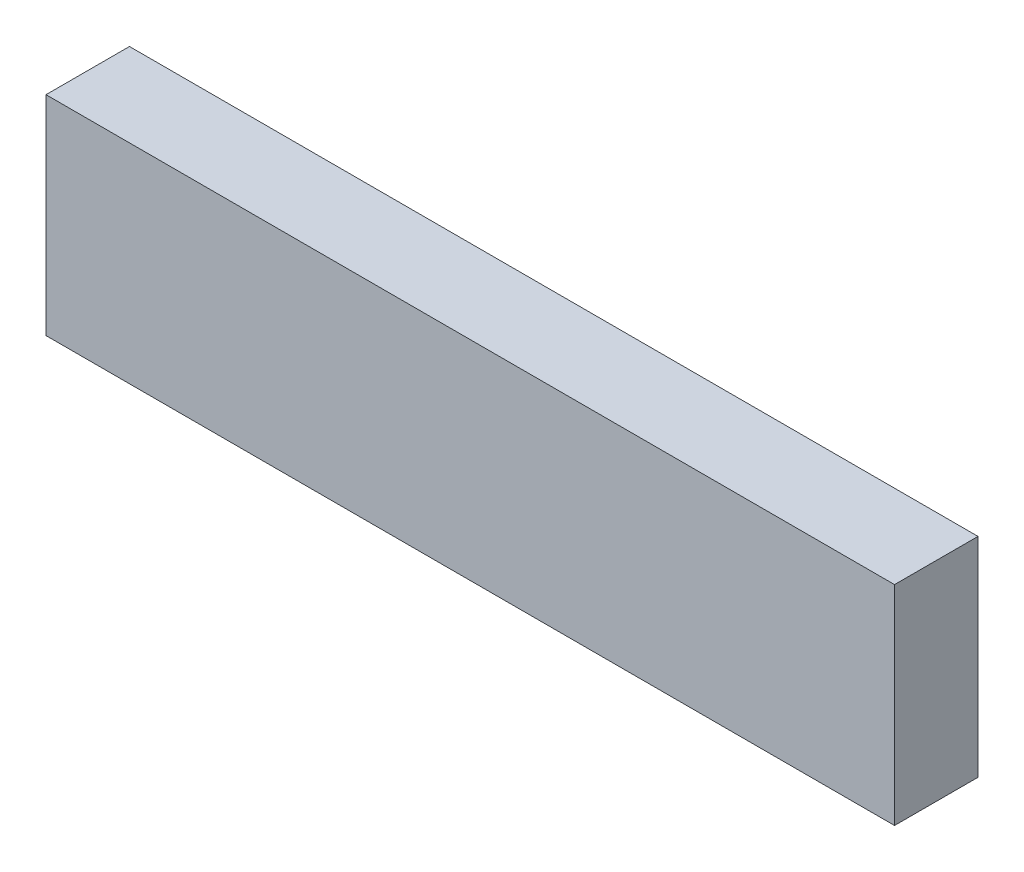
ISO-10303-21;
HEADER;
FILE_DESCRIPTION(('STEP AP214'),'2;1');
FILE_NAME('part.step','',(''),(''),'','','');
FILE_SCHEMA(('AUTOMOTIVE_DESIGN { 1 0 10303 214 1 1 1 1 }'));
ENDSEC;
DATA;
#1=APPLICATION_CONTEXT('core data for automotive mechanical design processes');
#2=APPLICATION_PROTOCOL_DEFINITION('international standard','automotive_design',2000,#1);
#3=PRODUCT_CONTEXT('',#1,'mechanical');
#4=PRODUCT('Part','Part','',(#3));
#5=PRODUCT_RELATED_PRODUCT_CATEGORY('part','',(#4));
#6=PRODUCT_DEFINITION_FORMATION('','',#4);
#7=PRODUCT_DEFINITION_CONTEXT('part definition',#1,'design');
#8=PRODUCT_DEFINITION('design','',#6,#7);
#9=PRODUCT_DEFINITION_SHAPE('','',#8);
#10=(LENGTH_UNIT() NAMED_UNIT(*) SI_UNIT(.MILLI.,.METRE.));
#11=(NAMED_UNIT(*) PLANE_ANGLE_UNIT() SI_UNIT($,.RADIAN.));
#12=(NAMED_UNIT(*) SI_UNIT($,.STERADIAN.) SOLID_ANGLE_UNIT());
#13=UNCERTAINTY_MEASURE_WITH_UNIT(LENGTH_MEASURE(1.E-05),#10,'distance_accuracy_value','');
#14=(GEOMETRIC_REPRESENTATION_CONTEXT(3) GLOBAL_UNCERTAINTY_ASSIGNED_CONTEXT((#13)) GLOBAL_UNIT_ASSIGNED_CONTEXT((#10,
#11,#12)) REPRESENTATION_CONTEXT('',''));
#15=CARTESIAN_POINT('',(0.,0.,0.));
#16=DIRECTION('',(0.,0.,1.));
#17=DIRECTION('',(1.,0.,0.));
#18=AXIS2_PLACEMENT_3D('',#15,#16,#17);
#19=CARTESIAN_POINT('',(61.,15.,-6.));
#20=DIRECTION('',(0.,0.,1.));
#21=DIRECTION('',(0.,-1.,0.));
#22=AXIS2_PLACEMENT_3D('',#19,#20,#21);
#23=PLANE('',#22);
#24=DIRECTION('',(0.,1.,0.));
#25=VECTOR('',#24,1.);
#26=CARTESIAN_POINT('',(-61.,15.,-6.));
#27=LINE('',#26,#25);
#28=CARTESIAN_POINT('',(-61.,-15.,-6.));
#29=VERTEX_POINT('',#28);
#30=CARTESIAN_POINT('',(-61.,15.,-6.));
#31=VERTEX_POINT('',#30);
#32=EDGE_CURVE('E104',#29,#31,#27,.T.);
#33=ORIENTED_EDGE('',*,*,#32,.T.);
#34=DIRECTION('',(-1.,0.,0.));
#35=VECTOR('',#34,1.);
#36=CARTESIAN_POINT('',(61.,15.,-6.));
#37=LINE('',#36,#35);
#38=CARTESIAN_POINT('',(61.,15.,-6.));
#39=VERTEX_POINT('',#38);
#40=EDGE_CURVE('E11',#39,#31,#37,.T.);
#41=ORIENTED_EDGE('',*,*,#40,.F.);
#42=DIRECTION('',(0.,1.,0.));
#43=VECTOR('',#42,1.);
#44=CARTESIAN_POINT('',(61.,15.,-6.));
#45=LINE('',#44,#43);
#46=CARTESIAN_POINT('',(61.,-15.,-6.));
#47=VERTEX_POINT('',#46);
#48=EDGE_CURVE('E92',#47,#39,#45,.T.);
#49=ORIENTED_EDGE('',*,*,#48,.F.);
#50=DIRECTION('',(-1.,0.,0.));
#51=VECTOR('',#50,1.);
#52=CARTESIAN_POINT('',(61.,-15.,-6.));
#53=LINE('',#52,#51);
#54=EDGE_CURVE('E100',#47,#29,#53,.T.);
#55=ORIENTED_EDGE('',*,*,#54,.T.);
#56=EDGE_LOOP('',(#33,#41,#49,#55));
#57=FACE_BOUND('',#56,.T.);
#58=ADVANCED_FACE('F41',(#57),#23,.F.);
#59=CARTESIAN_POINT('',(61.,15.,6.));
#60=DIRECTION('',(0.,-1.,0.));
#61=DIRECTION('',(0.,0.,-1.));
#62=AXIS2_PLACEMENT_3D('',#59,#60,#61);
#63=PLANE('',#62);
#64=DIRECTION('',(0.,0.,1.));
#65=VECTOR('',#64,1.);
#66=CARTESIAN_POINT('',(-61.,15.,6.));
#67=LINE('',#66,#65);
#68=CARTESIAN_POINT('',(-61.,15.,6.));
#69=VERTEX_POINT('',#68);
#70=EDGE_CURVE('E96',#31,#69,#67,.T.);
#71=ORIENTED_EDGE('',*,*,#70,.T.);
#72=DIRECTION('',(-1.,0.,0.));
#73=VECTOR('',#72,1.);
#74=CARTESIAN_POINT('',(61.,15.,6.));
#75=LINE('',#74,#73);
#76=CARTESIAN_POINT('',(61.,15.,6.));
#77=VERTEX_POINT('',#76);
#78=EDGE_CURVE('E49',#77,#69,#75,.T.);
#79=ORIENTED_EDGE('',*,*,#78,.F.);
#80=DIRECTION('',(0.,0.,1.));
#81=VECTOR('',#80,1.);
#82=CARTESIAN_POINT('',(61.,15.,6.));
#83=LINE('',#82,#81);
#84=EDGE_CURVE('E87',#39,#77,#83,.T.);
#85=ORIENTED_EDGE('',*,*,#84,.F.);
#86=ORIENTED_EDGE('',*,*,#40,.T.);
#87=EDGE_LOOP('',(#71,#79,#85,#86));
#88=FACE_BOUND('',#87,.T.);
#89=ADVANCED_FACE('F95',(#88),#63,.F.);
#90=CARTESIAN_POINT('',(61.,15.,6.));
#91=DIRECTION('',(0.,0.,-1.));
#92=DIRECTION('',(0.,1.,0.));
#93=AXIS2_PLACEMENT_3D('',#90,#91,#92);
#94=PLANE('',#93);
#95=DIRECTION('',(0.,-1.,0.));
#96=VECTOR('',#95,1.);
#97=CARTESIAN_POINT('',(-61.,15.,6.));
#98=LINE('',#97,#96);
#99=CARTESIAN_POINT('',(-61.,-15.,6.));
#100=VERTEX_POINT('',#99);
#101=EDGE_CURVE('E74',#69,#100,#98,.T.);
#102=ORIENTED_EDGE('',*,*,#101,.T.);
#103=DIRECTION('',(-1.,0.,0.));
#104=VECTOR('',#103,1.);
#105=CARTESIAN_POINT('',(61.,-15.,6.));
#106=LINE('',#105,#104);
#107=CARTESIAN_POINT('',(61.,-15.,6.));
#108=VERTEX_POINT('',#107);
#109=EDGE_CURVE('E97',#108,#100,#106,.T.);
#110=ORIENTED_EDGE('',*,*,#109,.F.);
#111=DIRECTION('',(0.,-1.,0.));
#112=VECTOR('',#111,1.);
#113=CARTESIAN_POINT('',(61.,15.,6.));
#114=LINE('',#113,#112);
#115=EDGE_CURVE('E90',#77,#108,#114,.T.);
#116=ORIENTED_EDGE('',*,*,#115,.F.);
#117=ORIENTED_EDGE('',*,*,#78,.T.);
#118=EDGE_LOOP('',(#102,#110,#116,#117));
#119=FACE_BOUND('',#118,.T.);
#120=ADVANCED_FACE('F98',(#119),#94,.F.);
#121=CARTESIAN_POINT('',(61.,-15.,6.));
#122=DIRECTION('',(0.,1.,0.));
#123=DIRECTION('',(0.,0.,1.));
#124=AXIS2_PLACEMENT_3D('',#121,#122,#123);
#125=PLANE('',#124);
#126=DIRECTION('',(0.,0.,-1.));
#127=VECTOR('',#126,1.);
#128=CARTESIAN_POINT('',(-61.,-15.,6.));
#129=LINE('',#128,#127);
#130=EDGE_CURVE('E80',#100,#29,#129,.T.);
#131=ORIENTED_EDGE('',*,*,#130,.T.);
#132=ORIENTED_EDGE('',*,*,#54,.F.);
#133=DIRECTION('',(0.,0.,-1.));
#134=VECTOR('',#133,1.);
#135=CARTESIAN_POINT('',(61.,-15.,6.));
#136=LINE('',#135,#134);
#137=EDGE_CURVE('E57',#108,#47,#136,.T.);
#138=ORIENTED_EDGE('',*,*,#137,.F.);
#139=ORIENTED_EDGE('',*,*,#109,.T.);
#140=EDGE_LOOP('',(#131,#132,#138,#139));
#141=FACE_BOUND('',#140,.T.);
#142=ADVANCED_FACE('F111',(#141),#125,.F.);
#143=CARTESIAN_POINT('',(61.,0.,0.));
#144=DIRECTION('',(1.,0.,0.));
#145=DIRECTION('',(0.,0.,-1.));
#146=AXIS2_PLACEMENT_3D('',#143,#144,#145);
#147=PLANE('',#146);
#148=ORIENTED_EDGE('',*,*,#48,.T.);
#149=ORIENTED_EDGE('',*,*,#84,.T.);
#150=ORIENTED_EDGE('',*,*,#115,.T.);
#151=ORIENTED_EDGE('',*,*,#137,.T.);
#152=EDGE_LOOP('',(#148,#149,#150,#151));
#153=FACE_BOUND('',#152,.T.);
#154=ADVANCED_FACE('F88',(#153),#147,.T.);
#155=CARTESIAN_POINT('',(-61.,0.,0.));
#156=DIRECTION('',(1.,0.,0.));
#157=DIRECTION('',(0.,0.,-1.));
#158=AXIS2_PLACEMENT_3D('',#155,#156,#157);
#159=PLANE('',#158);
#160=ORIENTED_EDGE('',*,*,#32,.F.);
#161=ORIENTED_EDGE('',*,*,#130,.F.);
#162=ORIENTED_EDGE('',*,*,#101,.F.);
#163=ORIENTED_EDGE('',*,*,#70,.F.);
#164=EDGE_LOOP('',(#160,#161,#162,#163));
#165=FACE_BOUND('',#164,.T.);
#166=ADVANCED_FACE('F114',(#165),#159,.F.);
#167=CLOSED_SHELL('',(#58,#89,#120,#142,#154,#166));
#168=MANIFOLD_SOLID_BREP('B2',#167);
#169=ADVANCED_BREP_SHAPE_REPRESENTATION('',(#18,#168),#14);
#170=SHAPE_DEFINITION_REPRESENTATION(#9,#169);
ENDSEC;
END-ISO-10303-21;
